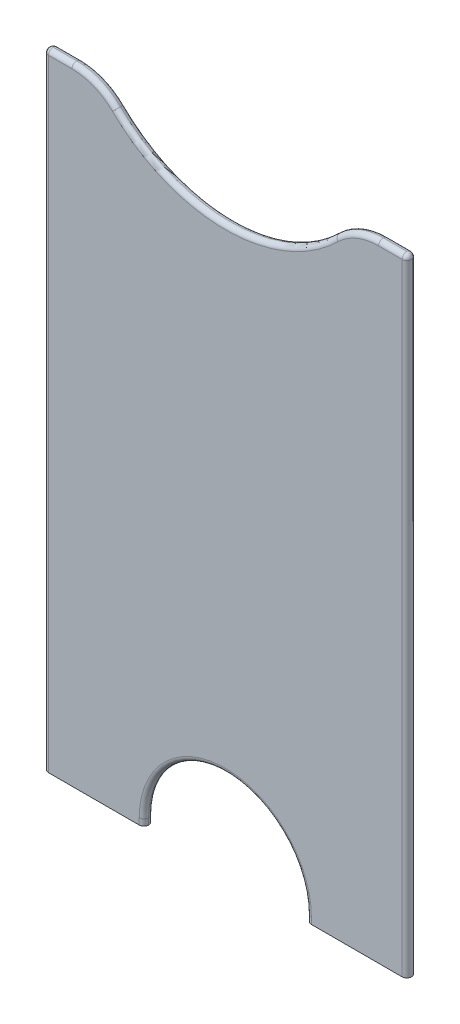
ISO-10303-21;
HEADER;
FILE_DESCRIPTION(('STEP AP214'),'2;1');
FILE_NAME('part.step','',(''),(''),'','','');
FILE_SCHEMA(('AUTOMOTIVE_DESIGN { 1 0 10303 214 1 1 1 1 }'));
ENDSEC;
DATA;
#1=APPLICATION_CONTEXT('core data for automotive mechanical design processes');
#2=APPLICATION_PROTOCOL_DEFINITION('international standard','automotive_design',2000,#1);
#3=PRODUCT_CONTEXT('',#1,'mechanical');
#4=PRODUCT('Part','Part','',(#3));
#5=PRODUCT_RELATED_PRODUCT_CATEGORY('part','',(#4));
#6=PRODUCT_DEFINITION_FORMATION('','',#4);
#7=PRODUCT_DEFINITION_CONTEXT('part definition',#1,'design');
#8=PRODUCT_DEFINITION('design','',#6,#7);
#9=PRODUCT_DEFINITION_SHAPE('','',#8);
#10=(LENGTH_UNIT() NAMED_UNIT(*) SI_UNIT(.MILLI.,.METRE.));
#11=(NAMED_UNIT(*) PLANE_ANGLE_UNIT() SI_UNIT($,.RADIAN.));
#12=(NAMED_UNIT(*) SI_UNIT($,.STERADIAN.) SOLID_ANGLE_UNIT());
#13=UNCERTAINTY_MEASURE_WITH_UNIT(LENGTH_MEASURE(1.E-05),#10,'distance_accuracy_value','');
#14=(GEOMETRIC_REPRESENTATION_CONTEXT(3) GLOBAL_UNCERTAINTY_ASSIGNED_CONTEXT((#13)) GLOBAL_UNIT_ASSIGNED_CONTEXT((#10,
#11,#12)) REPRESENTATION_CONTEXT('',''));
#15=CARTESIAN_POINT('',(0.,0.,0.));
#16=DIRECTION('',(0.,0.,1.));
#17=DIRECTION('',(1.,0.,0.));
#18=AXIS2_PLACEMENT_3D('',#15,#16,#17);
#19=CARTESIAN_POINT('',(-28.25,0.,-0.749999999999995));
#20=DIRECTION('',(0.,1.,0.));
#21=DIRECTION('',(0.,0.,1.));
#22=AXIS2_PLACEMENT_3D('',#19,#20,#21);
#23=PLANE('',#22);
#24=DIRECTION('',(-1.,0.,0.));
#25=VECTOR('',#24,1.);
#26=CARTESIAN_POINT('',(28.25,0.,-1.49999999999999));
#27=LINE('',#26,#25);
#28=CARTESIAN_POINT('',(-13.75,0.,-1.49999999999999));
#29=VERTEX_POINT('',#28);
#30=CARTESIAN_POINT('',(-28.25,0.,-1.49999999999999));
#31=VERTEX_POINT('',#30);
#32=EDGE_CURVE('E266',#29,#31,#27,.T.);
#33=ORIENTED_EDGE('',*,*,#32,.F.);
#34=CARTESIAN_POINT('',(-13.75,0.,-0.749999999999995));
#35=DIRECTION('',(0.,1.,0.));
#36=DIRECTION('',(0.,0.,1.));
#37=AXIS2_PLACEMENT_3D('',#34,#35,#36);
#38=CIRCLE('',#37,0.75);
#39=CARTESIAN_POINT('',(-13.,0.,-0.750000000000001));
#40=VERTEX_POINT('',#39);
#41=EDGE_CURVE('E134',#29,#40,#38,.F.);
#42=ORIENTED_EDGE('',*,*,#41,.T.);
#43=CARTESIAN_POINT('',(-13.75,0.,-0.750000000000001));
#44=DIRECTION('',(0.,1.,0.));
#45=DIRECTION('',(0.,0.,1.));
#46=AXIS2_PLACEMENT_3D('',#43,#44,#45);
#47=CIRCLE('',#46,0.75);
#48=CARTESIAN_POINT('',(-13.75,0.,0.));
#49=VERTEX_POINT('',#48);
#50=EDGE_CURVE('E127',#40,#49,#47,.F.);
#51=ORIENTED_EDGE('',*,*,#50,.T.);
#52=DIRECTION('',(1.,0.,0.));
#53=VECTOR('',#52,1.);
#54=CARTESIAN_POINT('',(-28.25,0.,0.));
#55=LINE('',#54,#53);
#56=CARTESIAN_POINT('',(-28.25,0.,0.));
#57=VERTEX_POINT('',#56);
#58=EDGE_CURVE('E131',#57,#49,#55,.T.);
#59=ORIENTED_EDGE('',*,*,#58,.F.);
#60=CARTESIAN_POINT('',(-28.25,0.,-0.749999999999995));
#61=DIRECTION('',(0.,1.,0.));
#62=DIRECTION('',(0.,0.,1.));
#63=AXIS2_PLACEMENT_3D('',#60,#61,#62);
#64=CIRCLE('',#63,0.749999999999997);
#65=EDGE_CURVE('E251',#31,#57,#64,.T.);
#66=ORIENTED_EDGE('',*,*,#65,.F.);
#67=EDGE_LOOP('',(#33,#42,#51,#59,#66));
#68=FACE_BOUND('',#67,.T.);
#69=ADVANCED_FACE('F40',(#68),#23,.F.);
#70=CARTESIAN_POINT('',(-28.25,100.,-0.749999999999995));
#71=DIRECTION('',(0.,-1.,0.));
#72=DIRECTION('',(0.,0.,-1.));
#73=AXIS2_PLACEMENT_3D('',#70,#71,#72);
#74=CYLINDRICAL_SURFACE('',#73,0.749999999999997);
#75=DIRECTION('',(0.,-1.,0.));
#76=VECTOR('',#75,1.);
#77=CARTESIAN_POINT('',(-28.25,100.,0.));
#78=LINE('',#77,#76);
#79=CARTESIAN_POINT('',(-28.25,99.25,0.));
#80=VERTEX_POINT('',#79);
#81=EDGE_CURVE('E143',#80,#57,#78,.T.);
#82=ORIENTED_EDGE('',*,*,#81,.F.);
#83=CARTESIAN_POINT('',(-28.25,99.25,-0.749999999999995));
#84=DIRECTION('',(0.,-1.,0.));
#85=DIRECTION('',(0.,0.,-1.));
#86=AXIS2_PLACEMENT_3D('',#83,#84,#85);
#87=CIRCLE('',#86,0.749999999999997);
#88=CARTESIAN_POINT('',(-28.25,99.25,-1.49999999999999));
#89=VERTEX_POINT('',#88);
#90=EDGE_CURVE('E195',#80,#89,#87,.T.);
#91=ORIENTED_EDGE('',*,*,#90,.T.);
#92=DIRECTION('',(0.,-1.,0.));
#93=VECTOR('',#92,1.);
#94=CARTESIAN_POINT('',(-28.25,100.,-1.49999999999999));
#95=LINE('',#94,#93);
#96=EDGE_CURVE('E273',#89,#31,#95,.T.);
#97=ORIENTED_EDGE('',*,*,#96,.T.);
#98=ORIENTED_EDGE('',*,*,#65,.T.);
#99=EDGE_LOOP('',(#82,#91,#97,#98));
#100=FACE_BOUND('',#99,.T.);
#101=ADVANCED_FACE('F326',(#100),#74,.T.);
#102=CARTESIAN_POINT('',(-28.25,100.,0.));
#103=DIRECTION('',(0.,0.,-1.));
#104=DIRECTION('',(-1.,0.,0.));
#105=AXIS2_PLACEMENT_3D('',#102,#103,#104);
#106=PLANE('',#105);
#107=CARTESIAN_POINT('',(0.,1.,0.));
#108=DIRECTION('',(0.,0.,-1.));
#109=DIRECTION('',(-1.,0.,0.));
#110=AXIS2_PLACEMENT_3D('',#107,#108,#109);
#111=CIRCLE('',#110,13.75);
#112=CARTESIAN_POINT('',(-13.75,1.,0.));
#113=VERTEX_POINT('',#112);
#114=CARTESIAN_POINT('',(13.75,1.,0.));
#115=VERTEX_POINT('',#114);
#116=EDGE_CURVE('E59',#113,#115,#111,.T.);
#117=ORIENTED_EDGE('',*,*,#116,.T.);
#118=DIRECTION('',(0.,1.,0.));
#119=VECTOR('',#118,1.);
#120=CARTESIAN_POINT('',(13.7499999999998,100.,0.));
#121=LINE('',#120,#119);
#122=CARTESIAN_POINT('',(13.75,0.,0.));
#123=VERTEX_POINT('',#122);
#124=EDGE_CURVE('E11',#115,#123,#121,.F.);
#125=ORIENTED_EDGE('',*,*,#124,.T.);
#126=CARTESIAN_POINT('',(28.25,0.,0.));
#127=VERTEX_POINT('',#126);
#128=EDGE_CURVE('E146',#123,#127,#55,.T.);
#129=ORIENTED_EDGE('',*,*,#128,.T.);
#130=DIRECTION('',(0.,-1.,0.));
#131=VECTOR('',#130,1.);
#132=CARTESIAN_POINT('',(28.25,100.,0.));
#133=LINE('',#132,#131);
#134=CARTESIAN_POINT('',(28.25,99.25,0.));
#135=VERTEX_POINT('',#134);
#136=EDGE_CURVE('E292',#135,#127,#133,.T.);
#137=ORIENTED_EDGE('',*,*,#136,.F.);
#138=DIRECTION('',(1.,0.,0.));
#139=VECTOR('',#138,1.);
#140=CARTESIAN_POINT('',(24.4948974278318,99.25,0.));
#141=LINE('',#140,#139);
#142=CARTESIAN_POINT('',(24.4948974278318,99.25,0.));
#143=VERTEX_POINT('',#142);
#144=EDGE_CURVE('E277',#135,#143,#141,.F.);
#145=ORIENTED_EDGE('',*,*,#144,.T.);
#146=CARTESIAN_POINT('',(24.4948974278318,90.,0.));
#147=DIRECTION('',(0.,0.,-1.));
#148=DIRECTION('',(-1.,0.,0.));
#149=AXIS2_PLACEMENT_3D('',#146,#147,#148);
#150=CIRCLE('',#149,9.25);
#151=CARTESIAN_POINT('',(18.021245964762,96.6071428571429,0.));
#152=VERTEX_POINT('',#151);
#153=EDGE_CURVE('E274',#143,#152,#150,.F.);
#154=ORIENTED_EDGE('',*,*,#153,.T.);
#155=CARTESIAN_POINT('',(0.,115.,0.));
#156=DIRECTION('',(0.,0.,-1.));
#157=DIRECTION('',(-1.,0.,0.));
#158=AXIS2_PLACEMENT_3D('',#155,#156,#157);
#159=CIRCLE('',#158,25.75);
#160=CARTESIAN_POINT('',(-18.021245964762,96.6071428571429,0.));
#161=VERTEX_POINT('',#160);
#162=EDGE_CURVE('E278',#152,#161,#159,.T.);
#163=ORIENTED_EDGE('',*,*,#162,.T.);
#164=CARTESIAN_POINT('',(-24.4948974278318,90.,0.));
#165=DIRECTION('',(0.,0.,-1.));
#166=DIRECTION('',(-1.,0.,0.));
#167=AXIS2_PLACEMENT_3D('',#164,#165,#166);
#168=CIRCLE('',#167,9.25);
#169=CARTESIAN_POINT('',(-24.4948974278318,99.25,0.));
#170=VERTEX_POINT('',#169);
#171=EDGE_CURVE('E280',#161,#170,#168,.F.);
#172=ORIENTED_EDGE('',*,*,#171,.T.);
#173=DIRECTION('',(1.,0.,0.));
#174=VECTOR('',#173,1.);
#175=CARTESIAN_POINT('',(-28.25,99.25,0.));
#176=LINE('',#175,#174);
#177=EDGE_CURVE('E283',#170,#80,#176,.F.);
#178=ORIENTED_EDGE('',*,*,#177,.T.);
#179=ORIENTED_EDGE('',*,*,#81,.T.);
#180=ORIENTED_EDGE('',*,*,#58,.T.);
#181=DIRECTION('',(0.,-1.,0.));
#182=VECTOR('',#181,1.);
#183=CARTESIAN_POINT('',(-13.7499999999998,100.,0.));
#184=LINE('',#183,#182);
#185=EDGE_CURVE('E51',#49,#113,#184,.F.);
#186=ORIENTED_EDGE('',*,*,#185,.T.);
#187=EDGE_LOOP('',(#117,#125,#129,#137,#145,#154,#163,#172,#178,#179,#180,#186));
#188=FACE_BOUND('',#187,.T.);
#189=ADVANCED_FACE('F140',(#188),#106,.F.);
#190=CARTESIAN_POINT('',(28.25,100.,-0.749999999999995));
#191=DIRECTION('',(0.,-1.,0.));
#192=DIRECTION('',(0.,0.,-1.));
#193=AXIS2_PLACEMENT_3D('',#190,#191,#192);
#194=CYLINDRICAL_SURFACE('',#193,0.749999999999997);
#195=DIRECTION('',(0.,-1.,0.));
#196=VECTOR('',#195,1.);
#197=CARTESIAN_POINT('',(28.25,100.,-1.49999999999999));
#198=LINE('',#197,#196);
#199=CARTESIAN_POINT('',(28.25,99.25,-1.49999999999999));
#200=VERTEX_POINT('',#199);
#201=CARTESIAN_POINT('',(28.25,0.,-1.49999999999999));
#202=VERTEX_POINT('',#201);
#203=EDGE_CURVE('E290',#200,#202,#198,.T.);
#204=ORIENTED_EDGE('',*,*,#203,.F.);
#205=CARTESIAN_POINT('',(28.25,99.25,-0.749999999999995));
#206=DIRECTION('',(0.,-1.,0.));
#207=DIRECTION('',(0.,0.,-1.));
#208=AXIS2_PLACEMENT_3D('',#205,#206,#207);
#209=CIRCLE('',#208,0.749999999999997);
#210=EDGE_CURVE('E305',#200,#135,#209,.T.);
#211=ORIENTED_EDGE('',*,*,#210,.T.);
#212=ORIENTED_EDGE('',*,*,#136,.T.);
#213=CARTESIAN_POINT('',(28.25,0.,-0.749999999999995));
#214=DIRECTION('',(0.,1.,0.));
#215=DIRECTION('',(0.,0.,1.));
#216=AXIS2_PLACEMENT_3D('',#213,#214,#215);
#217=CIRCLE('',#216,0.749999999999997);
#218=EDGE_CURVE('E145',#127,#202,#217,.T.);
#219=ORIENTED_EDGE('',*,*,#218,.T.);
#220=EDGE_LOOP('',(#204,#211,#212,#219));
#221=FACE_BOUND('',#220,.T.);
#222=ADVANCED_FACE('F372',(#221),#194,.T.);
#223=CARTESIAN_POINT('',(28.25,100.,-1.49999999999999));
#224=DIRECTION('',(0.,0.,1.));
#225=DIRECTION('',(1.,0.,0.));
#226=AXIS2_PLACEMENT_3D('',#223,#224,#225);
#227=PLANE('',#226);
#228=CARTESIAN_POINT('',(13.75,0.,-1.49999999999999));
#229=VERTEX_POINT('',#228);
#230=EDGE_CURVE('E268',#202,#229,#27,.T.);
#231=ORIENTED_EDGE('',*,*,#230,.T.);
#232=DIRECTION('',(0.,1.,0.));
#233=VECTOR('',#232,1.);
#234=CARTESIAN_POINT('',(13.7499999999998,100.,-1.49999999999999));
#235=LINE('',#234,#233);
#236=CARTESIAN_POINT('',(13.75,1.,-1.49999999999999));
#237=VERTEX_POINT('',#236);
#238=EDGE_CURVE('E258',#229,#237,#235,.T.);
#239=ORIENTED_EDGE('',*,*,#238,.T.);
#240=CARTESIAN_POINT('',(0.,1.,-1.49999999999999));
#241=DIRECTION('',(0.,0.,1.));
#242=DIRECTION('',(1.,0.,0.));
#243=AXIS2_PLACEMENT_3D('',#240,#241,#242);
#244=CIRCLE('',#243,13.75);
#245=CARTESIAN_POINT('',(-13.75,1.,-1.49999999999999));
#246=VERTEX_POINT('',#245);
#247=EDGE_CURVE('E252',#237,#246,#244,.T.);
#248=ORIENTED_EDGE('',*,*,#247,.T.);
#249=DIRECTION('',(0.,-1.,0.));
#250=VECTOR('',#249,1.);
#251=CARTESIAN_POINT('',(-13.7499999999998,100.,-1.49999999999999));
#252=LINE('',#251,#250);
#253=EDGE_CURVE('E255',#246,#29,#252,.T.);
#254=ORIENTED_EDGE('',*,*,#253,.T.);
#255=ORIENTED_EDGE('',*,*,#32,.T.);
#256=ORIENTED_EDGE('',*,*,#96,.F.);
#257=DIRECTION('',(-1.,0.,0.));
#258=VECTOR('',#257,1.);
#259=CARTESIAN_POINT('',(-24.4948974278318,99.25,-1.49999999999999));
#260=LINE('',#259,#258);
#261=CARTESIAN_POINT('',(-24.4948974278318,99.25,-1.49999999999999));
#262=VERTEX_POINT('',#261);
#263=EDGE_CURVE('E339',#89,#262,#260,.F.);
#264=ORIENTED_EDGE('',*,*,#263,.T.);
#265=CARTESIAN_POINT('',(-24.4948974278318,90.,-1.49999999999999));
#266=DIRECTION('',(0.,0.,1.));
#267=DIRECTION('',(1.,0.,0.));
#268=AXIS2_PLACEMENT_3D('',#265,#266,#267);
#269=CIRCLE('',#268,9.25);
#270=CARTESIAN_POINT('',(-18.021245964762,96.6071428571429,-1.49999999999999));
#271=VERTEX_POINT('',#270);
#272=EDGE_CURVE('E308',#262,#271,#269,.F.);
#273=ORIENTED_EDGE('',*,*,#272,.T.);
#274=CARTESIAN_POINT('',(0.,115.,-1.49999999999999));
#275=DIRECTION('',(0.,0.,1.));
#276=DIRECTION('',(1.,0.,0.));
#277=AXIS2_PLACEMENT_3D('',#274,#275,#276);
#278=CIRCLE('',#277,25.75);
#279=CARTESIAN_POINT('',(18.021245964762,96.6071428571429,-1.49999999999999));
#280=VERTEX_POINT('',#279);
#281=EDGE_CURVE('E298',#271,#280,#278,.T.);
#282=ORIENTED_EDGE('',*,*,#281,.T.);
#283=CARTESIAN_POINT('',(24.4948974278318,90.,-1.49999999999999));
#284=DIRECTION('',(0.,0.,1.));
#285=DIRECTION('',(1.,0.,0.));
#286=AXIS2_PLACEMENT_3D('',#283,#284,#285);
#287=CIRCLE('',#286,9.25);
#288=CARTESIAN_POINT('',(24.4948974278318,99.25,-1.49999999999999));
#289=VERTEX_POINT('',#288);
#290=EDGE_CURVE('E295',#280,#289,#287,.F.);
#291=ORIENTED_EDGE('',*,*,#290,.T.);
#292=DIRECTION('',(-1.,0.,0.));
#293=VECTOR('',#292,1.);
#294=CARTESIAN_POINT('',(28.25,99.25,-1.49999999999999));
#295=LINE('',#294,#293);
#296=EDGE_CURVE('E297',#289,#200,#295,.F.);
#297=ORIENTED_EDGE('',*,*,#296,.T.);
#298=ORIENTED_EDGE('',*,*,#203,.T.);
#299=EDGE_LOOP('',(#231,#239,#248,#254,#255,#256,#264,#273,#282,#291,#297,#298));
#300=FACE_BOUND('',#299,.T.);
#301=ADVANCED_FACE('F336',(#300),#227,.F.);
#302=CARTESIAN_POINT('',(13.75,0.,-0.750000000000001));
#303=DIRECTION('',(0.,1.,0.));
#304=DIRECTION('',(0.,0.,1.));
#305=AXIS2_PLACEMENT_3D('',#302,#303,#304);
#306=CIRCLE('',#305,0.75);
#307=CARTESIAN_POINT('',(13.,0.,-0.750000000000001));
#308=VERTEX_POINT('',#307);
#309=EDGE_CURVE('E262',#123,#308,#306,.F.);
#310=ORIENTED_EDGE('',*,*,#309,.T.);
#311=CARTESIAN_POINT('',(13.75,0.,-0.749999999999995));
#312=DIRECTION('',(0.,1.,0.));
#313=DIRECTION('',(0.,0.,1.));
#314=AXIS2_PLACEMENT_3D('',#311,#312,#313);
#315=CIRCLE('',#314,0.75);
#316=EDGE_CURVE('E137',#308,#229,#315,.F.);
#317=ORIENTED_EDGE('',*,*,#316,.T.);
#318=ORIENTED_EDGE('',*,*,#230,.F.);
#319=ORIENTED_EDGE('',*,*,#218,.F.);
#320=ORIENTED_EDGE('',*,*,#128,.F.);
#321=EDGE_LOOP('',(#310,#317,#318,#319,#320));
#322=FACE_BOUND('',#321,.T.);
#323=ADVANCED_FACE('F374',(#322),#23,.F.);
#324=CARTESIAN_POINT('',(-28.25,99.25,-0.749999999999995));
#325=DIRECTION('',(0.,1.,0.));
#326=DIRECTION('',(0.,0.,1.));
#327=AXIS2_PLACEMENT_3D('',#324,#325,#326);
#328=SPHERICAL_SURFACE('',#327,0.75);
#329=CARTESIAN_POINT('',(-28.25,99.25,-0.749999999999992));
#330=DIRECTION('',(1.,0.,0.));
#331=DIRECTION('',(0.,0.,-1.));
#332=AXIS2_PLACEMENT_3D('',#329,#330,#331);
#333=CIRCLE('',#332,0.75);
#334=CARTESIAN_POINT('',(-28.25,100.,-0.749999999999995));
#335=VERTEX_POINT('',#334);
#336=EDGE_CURVE('E248',#89,#335,#333,.T.);
#337=ORIENTED_EDGE('',*,*,#336,.F.);
#338=ORIENTED_EDGE('',*,*,#90,.F.);
#339=CARTESIAN_POINT('',(-28.25,99.25,-0.749999999999995));
#340=DIRECTION('',(1.,0.,0.));
#341=DIRECTION('',(0.,0.,-1.));
#342=AXIS2_PLACEMENT_3D('',#339,#340,#341);
#343=CIRCLE('',#342,0.75);
#344=EDGE_CURVE('E244',#335,#80,#343,.T.);
#345=ORIENTED_EDGE('',*,*,#344,.F.);
#346=EDGE_LOOP('',(#337,#338,#345));
#347=FACE_BOUND('',#346,.T.);
#348=ADVANCED_FACE('F341',(#347),#328,.T.);
#349=CARTESIAN_POINT('',(-28.25,99.25,-0.749999999999995));
#350=DIRECTION('',(1.,0.,0.));
#351=DIRECTION('',(0.,0.,-1.));
#352=AXIS2_PLACEMENT_3D('',#349,#350,#351);
#353=CYLINDRICAL_SURFACE('',#352,0.75);
#354=ORIENTED_EDGE('',*,*,#263,.F.);
#355=ORIENTED_EDGE('',*,*,#336,.T.);
#356=DIRECTION('',(-1.,0.,0.));
#357=VECTOR('',#356,1.);
#358=CARTESIAN_POINT('',(-28.25,100.,-0.749999999999995));
#359=LINE('',#358,#357);
#360=CARTESIAN_POINT('',(-24.4948974278318,100.,-0.75));
#361=VERTEX_POINT('',#360);
#362=EDGE_CURVE('E240',#361,#335,#359,.T.);
#363=ORIENTED_EDGE('',*,*,#362,.F.);
#364=CARTESIAN_POINT('',(-24.4948974278318,99.25,-0.749999999999995));
#365=DIRECTION('',(1.,0.,0.));
#366=DIRECTION('',(0.,0.,-1.));
#367=AXIS2_PLACEMENT_3D('',#364,#365,#366);
#368=CIRCLE('',#367,0.75);
#369=EDGE_CURVE('E236',#262,#361,#368,.T.);
#370=ORIENTED_EDGE('',*,*,#369,.F.);
#371=EDGE_LOOP('',(#354,#355,#363,#370));
#372=FACE_BOUND('',#371,.T.);
#373=ADVANCED_FACE('F343',(#372),#353,.T.);
#374=CARTESIAN_POINT('',(-28.25,99.25,-0.749999999999995));
#375=DIRECTION('',(-1.,0.,0.));
#376=DIRECTION('',(0.,0.,1.));
#377=AXIS2_PLACEMENT_3D('',#374,#375,#376);
#378=CYLINDRICAL_SURFACE('',#377,0.75);
#379=ORIENTED_EDGE('',*,*,#344,.T.);
#380=ORIENTED_EDGE('',*,*,#177,.F.);
#381=CARTESIAN_POINT('',(-24.4948974278318,99.25,-0.749999999999995));
#382=DIRECTION('',(1.,0.,0.));
#383=DIRECTION('',(0.,0.,-1.));
#384=AXIS2_PLACEMENT_3D('',#381,#382,#383);
#385=CIRCLE('',#384,0.75);
#386=EDGE_CURVE('E229',#361,#170,#385,.T.);
#387=ORIENTED_EDGE('',*,*,#386,.F.);
#388=ORIENTED_EDGE('',*,*,#362,.T.);
#389=EDGE_LOOP('',(#379,#380,#387,#388));
#390=FACE_BOUND('',#389,.T.);
#391=ADVANCED_FACE('F445',(#390),#378,.T.);
#392=CARTESIAN_POINT('',(-24.4948974278318,90.,-0.749999999999995));
#393=DIRECTION('',(0.,0.,1.));
#394=DIRECTION('',(1.,0.,0.));
#395=AXIS2_PLACEMENT_3D('',#392,#393,#394);
#396=TOROIDAL_SURFACE('',#395,9.25,0.75);
#397=ORIENTED_EDGE('',*,*,#272,.F.);
#398=ORIENTED_EDGE('',*,*,#369,.T.);
#399=CARTESIAN_POINT('',(-24.4948974278318,90.,-0.749999999999995));
#400=DIRECTION('',(0.,0.,1.));
#401=DIRECTION('',(1.,0.,0.));
#402=AXIS2_PLACEMENT_3D('',#399,#400,#401);
#403=CIRCLE('',#402,10.);
#404=CARTESIAN_POINT('',(-17.4963553055941,97.1428571428572,-0.75));
#405=VERTEX_POINT('',#404);
#406=EDGE_CURVE('E225',#405,#361,#403,.T.);
#407=ORIENTED_EDGE('',*,*,#406,.F.);
#408=CARTESIAN_POINT('',(-18.021245964762,96.6071428571429,-0.749999999999995));
#409=DIRECTION('',(0.714285714285723,-0.699854212223757,0.));
#410=DIRECTION('',(0.699854212223757,0.714285714285723,0.));
#411=AXIS2_PLACEMENT_3D('',#408,#409,#410);
#412=CIRCLE('',#411,0.75);
#413=EDGE_CURVE('E222',#271,#405,#412,.T.);
#414=ORIENTED_EDGE('',*,*,#413,.F.);
#415=EDGE_LOOP('',(#397,#398,#407,#414));
#416=FACE_BOUND('',#415,.T.);
#417=ADVANCED_FACE('F441',(#416),#396,.T.);
#418=CARTESIAN_POINT('',(-28.25,99.25,-0.749999999999995));
#419=DIRECTION('',(1.,0.,0.));
#420=DIRECTION('',(0.,0.,-1.));
#421=AXIS2_PLACEMENT_3D('',#418,#419,#420);
#422=CYLINDRICAL_SURFACE('',#421,0.75);
#423=CARTESIAN_POINT('',(28.25,99.25,-0.749999999999995));
#424=DIRECTION('',(1.,0.,0.));
#425=DIRECTION('',(0.,0.,-1.));
#426=AXIS2_PLACEMENT_3D('',#423,#424,#425);
#427=CIRCLE('',#426,0.75);
#428=CARTESIAN_POINT('',(28.25,100.,-0.749999999999995));
#429=VERTEX_POINT('',#428);
#430=EDGE_CURVE('E233',#200,#429,#427,.T.);
#431=ORIENTED_EDGE('',*,*,#430,.F.);
#432=ORIENTED_EDGE('',*,*,#296,.F.);
#433=CARTESIAN_POINT('',(24.4948974278318,99.25,-0.749999999999995));
#434=DIRECTION('',(-1.,0.,0.));
#435=DIRECTION('',(0.,0.,1.));
#436=AXIS2_PLACEMENT_3D('',#433,#434,#435);
#437=CIRCLE('',#436,0.75);
#438=CARTESIAN_POINT('',(24.4948974278318,100.,-0.75));
#439=VERTEX_POINT('',#438);
#440=EDGE_CURVE('E216',#439,#289,#437,.T.);
#441=ORIENTED_EDGE('',*,*,#440,.F.);
#442=DIRECTION('',(-1.,0.,0.));
#443=VECTOR('',#442,1.);
#444=CARTESIAN_POINT('',(24.4948974278318,100.,-0.749999999999995));
#445=LINE('',#444,#443);
#446=EDGE_CURVE('E212',#429,#439,#445,.T.);
#447=ORIENTED_EDGE('',*,*,#446,.F.);
#448=EDGE_LOOP('',(#431,#432,#441,#447));
#449=FACE_BOUND('',#448,.T.);
#450=ADVANCED_FACE('F437',(#449),#422,.T.);
#451=CARTESIAN_POINT('',(28.25,99.25,-0.749999999999995));
#452=DIRECTION('',(0.,1.,0.));
#453=DIRECTION('',(0.,0.,1.));
#454=AXIS2_PLACEMENT_3D('',#451,#452,#453);
#455=SPHERICAL_SURFACE('',#454,0.75);
#456=ORIENTED_EDGE('',*,*,#210,.F.);
#457=ORIENTED_EDGE('',*,*,#430,.T.);
#458=CARTESIAN_POINT('',(28.25,99.25,-0.749999999999997));
#459=DIRECTION('',(-1.,0.,0.));
#460=DIRECTION('',(0.,0.,1.));
#461=AXIS2_PLACEMENT_3D('',#458,#459,#460);
#462=CIRCLE('',#461,0.75);
#463=EDGE_CURVE('E208',#135,#429,#462,.T.);
#464=ORIENTED_EDGE('',*,*,#463,.F.);
#465=EDGE_LOOP('',(#456,#457,#464));
#466=FACE_BOUND('',#465,.T.);
#467=ADVANCED_FACE('F433',(#466),#455,.T.);
#468=CARTESIAN_POINT('',(-24.4948974278318,90.,-0.75));
#469=DIRECTION('',(0.,0.,-1.));
#470=DIRECTION('',(-1.,0.,0.));
#471=AXIS2_PLACEMENT_3D('',#468,#469,#470);
#472=TOROIDAL_SURFACE('',#471,9.25,0.75);
#473=ORIENTED_EDGE('',*,*,#386,.T.);
#474=ORIENTED_EDGE('',*,*,#171,.F.);
#475=CARTESIAN_POINT('',(-18.021245964762,96.6071428571429,-0.75));
#476=DIRECTION('',(0.714285714285718,-0.699854212223761,0.));
#477=DIRECTION('',(0.699854212223761,0.714285714285718,0.));
#478=AXIS2_PLACEMENT_3D('',#475,#476,#477);
#479=CIRCLE('',#478,0.75);
#480=EDGE_CURVE('E204',#405,#161,#479,.T.);
#481=ORIENTED_EDGE('',*,*,#480,.F.);
#482=ORIENTED_EDGE('',*,*,#406,.T.);
#483=EDGE_LOOP('',(#473,#474,#481,#482));
#484=FACE_BOUND('',#483,.T.);
#485=ADVANCED_FACE('F429',(#484),#472,.T.);
#486=CARTESIAN_POINT('',(0.,115.,-0.749999999999995));
#487=DIRECTION('',(0.,0.,1.));
#488=DIRECTION('',(1.,0.,0.));
#489=AXIS2_PLACEMENT_3D('',#486,#487,#488);
#490=TOROIDAL_SURFACE('',#489,25.75,0.75);
#491=CARTESIAN_POINT('',(18.021245964762,96.6071428571429,-0.749999999999995));
#492=DIRECTION('',(0.714285714285723,0.699854212223757,0.));
#493=DIRECTION('',(-0.699854212223757,0.714285714285723,0.));
#494=AXIS2_PLACEMENT_3D('',#491,#492,#493);
#495=CIRCLE('',#494,0.75);
#496=CARTESIAN_POINT('',(17.4963553055941,97.1428571428572,-0.75));
#497=VERTEX_POINT('',#496);
#498=EDGE_CURVE('E85',#280,#497,#495,.T.);
#499=ORIENTED_EDGE('',*,*,#498,.F.);
#500=ORIENTED_EDGE('',*,*,#281,.F.);
#501=ORIENTED_EDGE('',*,*,#413,.T.);
#502=CARTESIAN_POINT('',(0.,115.,-0.749999999999995));
#503=DIRECTION('',(0.,0.,1.));
#504=DIRECTION('',(1.,0.,0.));
#505=AXIS2_PLACEMENT_3D('',#502,#503,#504);
#506=CIRCLE('',#505,25.);
#507=EDGE_CURVE('E200',#497,#405,#506,.F.);
#508=ORIENTED_EDGE('',*,*,#507,.F.);
#509=EDGE_LOOP('',(#499,#500,#501,#508));
#510=FACE_BOUND('',#509,.T.);
#511=ADVANCED_FACE('F426',(#510),#490,.T.);
#512=CARTESIAN_POINT('',(24.4948974278318,90.,-0.749999999999995));
#513=DIRECTION('',(0.,0.,1.));
#514=DIRECTION('',(1.,0.,0.));
#515=AXIS2_PLACEMENT_3D('',#512,#513,#514);
#516=TOROIDAL_SURFACE('',#515,9.25,0.75);
#517=ORIENTED_EDGE('',*,*,#290,.F.);
#518=ORIENTED_EDGE('',*,*,#498,.T.);
#519=CARTESIAN_POINT('',(24.4948974278318,90.,-0.749999999999995));
#520=DIRECTION('',(0.,0.,1.));
#521=DIRECTION('',(1.,0.,0.));
#522=AXIS2_PLACEMENT_3D('',#519,#520,#521);
#523=CIRCLE('',#522,10.);
#524=EDGE_CURVE('E192',#439,#497,#523,.T.);
#525=ORIENTED_EDGE('',*,*,#524,.F.);
#526=ORIENTED_EDGE('',*,*,#440,.T.);
#527=EDGE_LOOP('',(#517,#518,#525,#526));
#528=FACE_BOUND('',#527,.T.);
#529=ADVANCED_FACE('F422',(#528),#516,.T.);
#530=CARTESIAN_POINT('',(-28.25,99.25,-0.749999999999995));
#531=DIRECTION('',(-1.,0.,0.));
#532=DIRECTION('',(0.,0.,1.));
#533=AXIS2_PLACEMENT_3D('',#530,#531,#532);
#534=CYLINDRICAL_SURFACE('',#533,0.75);
#535=ORIENTED_EDGE('',*,*,#463,.T.);
#536=ORIENTED_EDGE('',*,*,#446,.T.);
#537=CARTESIAN_POINT('',(24.4948974278318,99.25,-0.75));
#538=DIRECTION('',(-1.,0.,0.));
#539=DIRECTION('',(0.,0.,1.));
#540=AXIS2_PLACEMENT_3D('',#537,#538,#539);
#541=CIRCLE('',#540,0.75);
#542=EDGE_CURVE('E181',#143,#439,#541,.T.);
#543=ORIENTED_EDGE('',*,*,#542,.F.);
#544=ORIENTED_EDGE('',*,*,#144,.F.);
#545=EDGE_LOOP('',(#535,#536,#543,#544));
#546=FACE_BOUND('',#545,.T.);
#547=ADVANCED_FACE('F418',(#546),#534,.T.);
#548=CARTESIAN_POINT('',(0.,115.,-0.75));
#549=DIRECTION('',(0.,0.,-1.));
#550=DIRECTION('',(-1.,0.,0.));
#551=AXIS2_PLACEMENT_3D('',#548,#549,#550);
#552=TOROIDAL_SURFACE('',#551,25.75,0.75);
#553=ORIENTED_EDGE('',*,*,#480,.T.);
#554=ORIENTED_EDGE('',*,*,#162,.F.);
#555=CARTESIAN_POINT('',(18.021245964762,96.6071428571429,-0.75));
#556=DIRECTION('',(0.714285714285718,0.699854212223761,0.));
#557=DIRECTION('',(-0.699854212223761,0.714285714285718,0.));
#558=AXIS2_PLACEMENT_3D('',#555,#556,#557);
#559=CIRCLE('',#558,0.75);
#560=EDGE_CURVE('E177',#497,#152,#559,.T.);
#561=ORIENTED_EDGE('',*,*,#560,.F.);
#562=ORIENTED_EDGE('',*,*,#507,.T.);
#563=EDGE_LOOP('',(#553,#554,#561,#562));
#564=FACE_BOUND('',#563,.T.);
#565=ADVANCED_FACE('F415',(#564),#552,.T.);
#566=CARTESIAN_POINT('',(24.4948974278318,90.,-0.75));
#567=DIRECTION('',(0.,0.,-1.));
#568=DIRECTION('',(-1.,0.,0.));
#569=AXIS2_PLACEMENT_3D('',#566,#567,#568);
#570=TOROIDAL_SURFACE('',#569,9.25,0.75);
#571=ORIENTED_EDGE('',*,*,#542,.T.);
#572=ORIENTED_EDGE('',*,*,#524,.T.);
#573=ORIENTED_EDGE('',*,*,#560,.T.);
#574=ORIENTED_EDGE('',*,*,#153,.F.);
#575=EDGE_LOOP('',(#571,#572,#573,#574));
#576=FACE_BOUND('',#575,.T.);
#577=ADVANCED_FACE('F412',(#576),#570,.T.);
#578=CARTESIAN_POINT('',(-13.75,1.,-0.750000000000001));
#579=DIRECTION('',(0.,-1.,0.));
#580=DIRECTION('',(1.,0.,0.));
#581=AXIS2_PLACEMENT_3D('',#578,#579,#580);
#582=CYLINDRICAL_SURFACE('',#581,0.75);
#583=ORIENTED_EDGE('',*,*,#185,.F.);
#584=ORIENTED_EDGE('',*,*,#50,.F.);
#585=DIRECTION('',(0.,-1.,0.));
#586=VECTOR('',#585,1.);
#587=CARTESIAN_POINT('',(-13.,1.,-0.750000000000001));
#588=LINE('',#587,#586);
#589=CARTESIAN_POINT('',(-13.,1.,-0.749999999999995));
#590=VERTEX_POINT('',#589);
#591=EDGE_CURVE('E44',#590,#40,#588,.T.);
#592=ORIENTED_EDGE('',*,*,#591,.F.);
#593=CARTESIAN_POINT('',(-13.75,1.,-0.75));
#594=DIRECTION('',(0.,1.,0.));
#595=DIRECTION('',(-1.,0.,0.));
#596=AXIS2_PLACEMENT_3D('',#593,#594,#595);
#597=CIRCLE('',#596,0.75);
#598=EDGE_CURVE('E148',#113,#590,#597,.T.);
#599=ORIENTED_EDGE('',*,*,#598,.F.);
#600=EDGE_LOOP('',(#583,#584,#592,#599));
#601=FACE_BOUND('',#600,.T.);
#602=ADVANCED_FACE('F42',(#601),#582,.T.);
#603=CARTESIAN_POINT('',(-13.7499999999998,100.,-0.749999999999995));
#604=DIRECTION('',(0.,-1.,0.));
#605=DIRECTION('',(1.,0.,0.));
#606=AXIS2_PLACEMENT_3D('',#603,#604,#605);
#607=CYLINDRICAL_SURFACE('',#606,0.75);
#608=ORIENTED_EDGE('',*,*,#41,.F.);
#609=ORIENTED_EDGE('',*,*,#253,.F.);
#610=CARTESIAN_POINT('',(-13.75,1.,-0.749999999999995));
#611=DIRECTION('',(0.,1.,0.));
#612=DIRECTION('',(-1.,0.,0.));
#613=AXIS2_PLACEMENT_3D('',#610,#611,#612);
#614=CIRCLE('',#613,0.75);
#615=EDGE_CURVE('E167',#590,#246,#614,.T.);
#616=ORIENTED_EDGE('',*,*,#615,.F.);
#617=ORIENTED_EDGE('',*,*,#591,.T.);
#618=EDGE_LOOP('',(#608,#609,#616,#617));
#619=FACE_BOUND('',#618,.T.);
#620=ADVANCED_FACE('F385',(#619),#607,.T.);
#621=CARTESIAN_POINT('',(0.,1.,-0.750000000000001));
#622=DIRECTION('',(0.,0.,-1.));
#623=DIRECTION('',(-1.,0.,0.));
#624=AXIS2_PLACEMENT_3D('',#621,#622,#623);
#625=TOROIDAL_SURFACE('',#624,13.75,0.75);
#626=CARTESIAN_POINT('',(13.75,1.,-0.75));
#627=DIRECTION('',(0.,-1.,0.));
#628=DIRECTION('',(1.,0.,0.));
#629=AXIS2_PLACEMENT_3D('',#626,#627,#628);
#630=CIRCLE('',#629,0.75);
#631=CARTESIAN_POINT('',(13.,1.,-0.749999999999995));
#632=VERTEX_POINT('',#631);
#633=EDGE_CURVE('E69',#115,#632,#630,.T.);
#634=ORIENTED_EDGE('',*,*,#633,.F.);
#635=ORIENTED_EDGE('',*,*,#116,.F.);
#636=ORIENTED_EDGE('',*,*,#598,.T.);
#637=CARTESIAN_POINT('',(0.,1.,-0.750000000000001));
#638=DIRECTION('',(0.,0.,-1.));
#639=DIRECTION('',(-1.,0.,0.));
#640=AXIS2_PLACEMENT_3D('',#637,#638,#639);
#641=CIRCLE('',#640,13.);
#642=EDGE_CURVE('E163',#632,#590,#641,.F.);
#643=ORIENTED_EDGE('',*,*,#642,.F.);
#644=EDGE_LOOP('',(#634,#635,#636,#643));
#645=FACE_BOUND('',#644,.T.);
#646=ADVANCED_FACE('F386',(#645),#625,.T.);
#647=CARTESIAN_POINT('',(13.75,1.,-0.750000000000001));
#648=DIRECTION('',(0.,1.,0.));
#649=DIRECTION('',(-1.,0.,0.));
#650=AXIS2_PLACEMENT_3D('',#647,#648,#649);
#651=CYLINDRICAL_SURFACE('',#650,0.75);
#652=ORIENTED_EDGE('',*,*,#124,.F.);
#653=ORIENTED_EDGE('',*,*,#633,.T.);
#654=DIRECTION('',(0.,1.,0.));
#655=VECTOR('',#654,1.);
#656=CARTESIAN_POINT('',(13.,1.,-0.750000000000001));
#657=LINE('',#656,#655);
#658=EDGE_CURVE('E159',#308,#632,#657,.T.);
#659=ORIENTED_EDGE('',*,*,#658,.F.);
#660=ORIENTED_EDGE('',*,*,#309,.F.);
#661=EDGE_LOOP('',(#652,#653,#659,#660));
#662=FACE_BOUND('',#661,.T.);
#663=ADVANCED_FACE('F387',(#662),#651,.T.);
#664=CARTESIAN_POINT('',(0.,1.,-0.749999999999995));
#665=DIRECTION('',(0.,0.,1.));
#666=DIRECTION('',(1.,0.,0.));
#667=AXIS2_PLACEMENT_3D('',#664,#665,#666);
#668=TOROIDAL_SURFACE('',#667,13.75,0.75);
#669=ORIENTED_EDGE('',*,*,#615,.T.);
#670=ORIENTED_EDGE('',*,*,#247,.F.);
#671=CARTESIAN_POINT('',(13.75,1.,-0.749999999999995));
#672=DIRECTION('',(0.,-1.,0.));
#673=DIRECTION('',(0.,0.,-1.));
#674=AXIS2_PLACEMENT_3D('',#671,#672,#673);
#675=CIRCLE('',#674,0.75);
#676=EDGE_CURVE('E156',#632,#237,#675,.T.);
#677=ORIENTED_EDGE('',*,*,#676,.F.);
#678=ORIENTED_EDGE('',*,*,#642,.T.);
#679=EDGE_LOOP('',(#669,#670,#677,#678));
#680=FACE_BOUND('',#679,.T.);
#681=ADVANCED_FACE('F383',(#680),#668,.T.);
#682=CARTESIAN_POINT('',(13.7499999999998,100.,-0.749999999999995));
#683=DIRECTION('',(0.,1.,0.));
#684=DIRECTION('',(-1.,0.,0.));
#685=AXIS2_PLACEMENT_3D('',#682,#683,#684);
#686=CYLINDRICAL_SURFACE('',#685,0.75);
#687=ORIENTED_EDGE('',*,*,#316,.F.);
#688=ORIENTED_EDGE('',*,*,#658,.T.);
#689=ORIENTED_EDGE('',*,*,#676,.T.);
#690=ORIENTED_EDGE('',*,*,#238,.F.);
#691=EDGE_LOOP('',(#687,#688,#689,#690));
#692=FACE_BOUND('',#691,.T.);
#693=ADVANCED_FACE('F379',(#692),#686,.T.);
#694=CLOSED_SHELL('',(#69,#101,#189,#222,#301,#323,#348,#373,#391,#417,#450,#467,#485,#511,#529,
#547,#565,#577,#602,#620,#646,#663,#681,#693));
#695=MANIFOLD_SOLID_BREP('B2',#694);
#696=ADVANCED_BREP_SHAPE_REPRESENTATION('',(#18,#695),#14);
#697=SHAPE_DEFINITION_REPRESENTATION(#9,#696);
ENDSEC;
END-ISO-10303-21;
